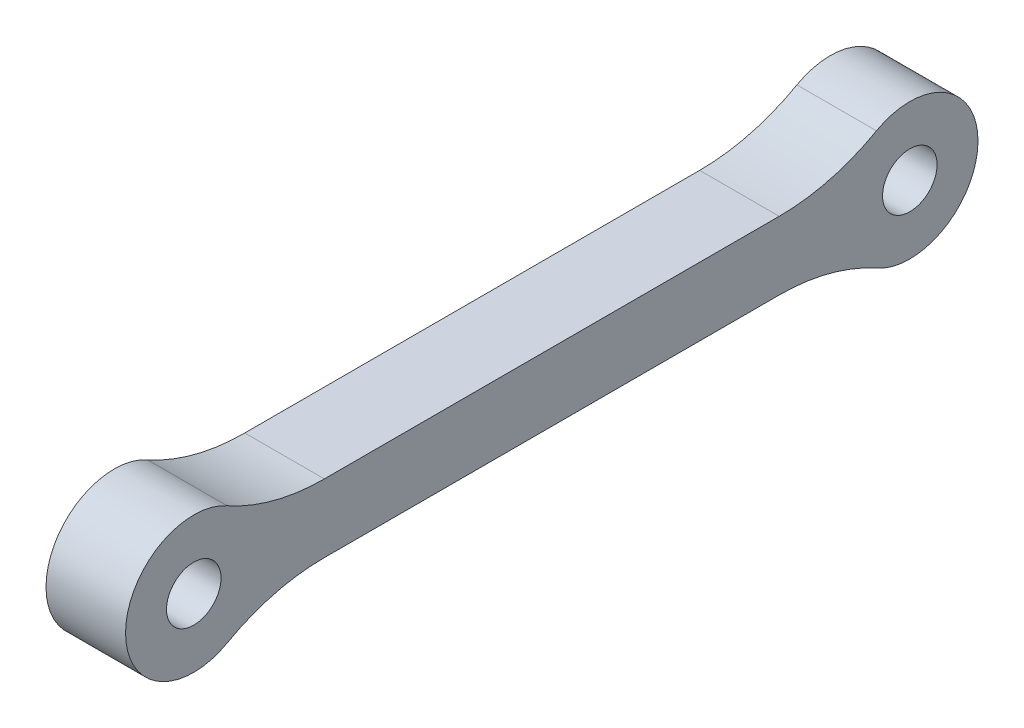
ISO-10303-21;
HEADER;
FILE_DESCRIPTION(('STEP AP214'),'2;1');
FILE_NAME('part.step','',(''),(''),'','','');
FILE_SCHEMA(('AUTOMOTIVE_DESIGN { 1 0 10303 214 1 1 1 1 }'));
ENDSEC;
DATA;
#1=APPLICATION_CONTEXT('core data for automotive mechanical design processes');
#2=APPLICATION_PROTOCOL_DEFINITION('international standard','automotive_design',2000,#1);
#3=PRODUCT_CONTEXT('',#1,'mechanical');
#4=PRODUCT('Part','Part','',(#3));
#5=PRODUCT_RELATED_PRODUCT_CATEGORY('part','',(#4));
#6=PRODUCT_DEFINITION_FORMATION('','',#4);
#7=PRODUCT_DEFINITION_CONTEXT('part definition',#1,'design');
#8=PRODUCT_DEFINITION('design','',#6,#7);
#9=PRODUCT_DEFINITION_SHAPE('','',#8);
#10=(LENGTH_UNIT() NAMED_UNIT(*) SI_UNIT(.MILLI.,.METRE.));
#11=(NAMED_UNIT(*) PLANE_ANGLE_UNIT() SI_UNIT($,.RADIAN.));
#12=(NAMED_UNIT(*) SI_UNIT($,.STERADIAN.) SOLID_ANGLE_UNIT());
#13=UNCERTAINTY_MEASURE_WITH_UNIT(LENGTH_MEASURE(1.E-05),#10,'distance_accuracy_value','');
#14=(GEOMETRIC_REPRESENTATION_CONTEXT(3) GLOBAL_UNCERTAINTY_ASSIGNED_CONTEXT((#13)) GLOBAL_UNIT_ASSIGNED_CONTEXT((#10,
#11,#12)) REPRESENTATION_CONTEXT('',''));
#15=CARTESIAN_POINT('',(0.,0.,0.));
#16=DIRECTION('',(0.,0.,1.));
#17=DIRECTION('',(1.,0.,0.));
#18=AXIS2_PLACEMENT_3D('',#15,#16,#17);
#19=CARTESIAN_POINT('',(4.,0.,0.));
#20=DIRECTION('',(1.,0.,0.));
#21=DIRECTION('',(0.,0.,-1.));
#22=AXIS2_PLACEMENT_3D('',#19,#20,#21);
#23=PLANE('',#22);
#24=CARTESIAN_POINT('',(4.,0.,0.));
#25=DIRECTION('',(1.,0.,0.));
#26=DIRECTION('',(0.,0.,-1.));
#27=AXIS2_PLACEMENT_3D('',#24,#25,#26);
#28=CIRCLE('',#27,1.37142857142857);
#29=CARTESIAN_POINT('',(4.,0.,-1.37142857142857));
#30=VERTEX_POINT('',#29);
#31=EDGE_CURVE('E142',#30,#30,#28,.T.);
#32=ORIENTED_EDGE('',*,*,#31,.F.);
#33=EDGE_LOOP('',(#32));
#34=FACE_BOUND('',#33,.T.);
#35=CARTESIAN_POINT('',(4.,0.,-36.));
#36=DIRECTION('',(1.,0.,0.));
#37=DIRECTION('',(0.,0.,-1.));
#38=AXIS2_PLACEMENT_3D('',#35,#36,#37);
#39=CIRCLE('',#38,3.42857142857143);
#40=CARTESIAN_POINT('',(4.,-2.99088145896657,-34.323775033229));
#41=VERTEX_POINT('',#40);
#42=CARTESIAN_POINT('',(4.,2.99088145896657,-34.323775033229));
#43=VERTEX_POINT('',#42);
#44=EDGE_CURVE('E153',#41,#43,#39,.T.);
#45=ORIENTED_EDGE('',*,*,#44,.T.);
#46=CARTESIAN_POINT('',(4.,11.7142857142857,-29.4347855468137));
#47=DIRECTION('',(1.,0.,0.));
#48=DIRECTION('',(0.,0.,-1.));
#49=AXIS2_PLACEMENT_3D('',#46,#47,#48);
#50=CIRCLE('',#49,10.);
#51=CARTESIAN_POINT('',(4.,1.71428571428571,-29.4347855468137));
#52=VERTEX_POINT('',#51);
#53=EDGE_CURVE('E11',#43,#52,#50,.F.);
#54=ORIENTED_EDGE('',*,*,#53,.T.);
#55=DIRECTION('',(0.,0.,1.));
#56=VECTOR('',#55,1.);
#57=CARTESIAN_POINT('',(4.,1.71428571428571,-18.));
#58=LINE('',#57,#56);
#59=CARTESIAN_POINT('',(4.,1.71428571428571,-6.56521445318632));
#60=VERTEX_POINT('',#59);
#61=EDGE_CURVE('E161',#52,#60,#58,.T.);
#62=ORIENTED_EDGE('',*,*,#61,.T.);
#63=CARTESIAN_POINT('',(4.,11.7142857142857,-6.56521445318632));
#64=DIRECTION('',(1.,0.,0.));
#65=DIRECTION('',(0.,0.,-1.));
#66=AXIS2_PLACEMENT_3D('',#63,#64,#65);
#67=CIRCLE('',#66,10.);
#68=CARTESIAN_POINT('',(4.,2.99088145896656,-1.67622496677098));
#69=VERTEX_POINT('',#68);
#70=EDGE_CURVE('E121',#60,#69,#67,.F.);
#71=ORIENTED_EDGE('',*,*,#70,.T.);
#72=CARTESIAN_POINT('',(4.,0.,0.));
#73=DIRECTION('',(1.,0.,0.));
#74=DIRECTION('',(0.,0.,-1.));
#75=AXIS2_PLACEMENT_3D('',#72,#73,#74);
#76=CIRCLE('',#75,3.42857142857143);
#77=CARTESIAN_POINT('',(4.,-2.99088145896656,-1.67622496677098));
#78=VERTEX_POINT('',#77);
#79=EDGE_CURVE('E131',#69,#78,#76,.T.);
#80=ORIENTED_EDGE('',*,*,#79,.T.);
#81=CARTESIAN_POINT('',(4.,-11.7142857142857,-6.56521445318632));
#82=DIRECTION('',(1.,0.,0.));
#83=DIRECTION('',(0.,0.,-1.));
#84=AXIS2_PLACEMENT_3D('',#81,#82,#83);
#85=CIRCLE('',#84,10.);
#86=CARTESIAN_POINT('',(4.,-1.71428571428571,-6.56521445318632));
#87=VERTEX_POINT('',#86);
#88=EDGE_CURVE('E185',#78,#87,#85,.F.);
#89=ORIENTED_EDGE('',*,*,#88,.T.);
#90=DIRECTION('',(0.,0.,-1.));
#91=VECTOR('',#90,1.);
#92=CARTESIAN_POINT('',(4.,-1.71428571428571,-18.));
#93=LINE('',#92,#91);
#94=CARTESIAN_POINT('',(4.,-1.71428571428571,-29.4347855468137));
#95=VERTEX_POINT('',#94);
#96=EDGE_CURVE('E207',#87,#95,#93,.T.);
#97=ORIENTED_EDGE('',*,*,#96,.T.);
#98=CARTESIAN_POINT('',(4.,-11.7142857142857,-29.4347855468137));
#99=DIRECTION('',(1.,0.,0.));
#100=DIRECTION('',(0.,0.,-1.));
#101=AXIS2_PLACEMENT_3D('',#98,#99,#100);
#102=CIRCLE('',#101,10.);
#103=EDGE_CURVE('E66',#95,#41,#102,.F.);
#104=ORIENTED_EDGE('',*,*,#103,.T.);
#105=EDGE_LOOP('',(#45,#54,#62,#71,#80,#89,#97,#104));
#106=FACE_BOUND('',#105,.T.);
#107=CARTESIAN_POINT('',(4.,0.,-36.));
#108=DIRECTION('',(1.,0.,0.));
#109=DIRECTION('',(0.,0.,-1.));
#110=AXIS2_PLACEMENT_3D('',#107,#108,#109);
#111=CIRCLE('',#110,1.37142857142857);
#112=CARTESIAN_POINT('',(4.,0.,-37.3714285714286));
#113=VERTEX_POINT('',#112);
#114=EDGE_CURVE('E355',#113,#113,#111,.T.);
#115=ORIENTED_EDGE('',*,*,#114,.F.);
#116=EDGE_LOOP('',(#115));
#117=FACE_BOUND('',#116,.T.);
#118=ADVANCED_FACE('F43',(#34,#106,#117),#23,.T.);
#119=CARTESIAN_POINT('',(0.,0.,0.));
#120=DIRECTION('',(1.,0.,0.));
#121=DIRECTION('',(0.,0.,-1.));
#122=AXIS2_PLACEMENT_3D('',#119,#120,#121);
#123=PLANE('',#122);
#124=CARTESIAN_POINT('',(0.,0.,0.));
#125=DIRECTION('',(1.,0.,0.));
#126=DIRECTION('',(0.,0.,-1.));
#127=AXIS2_PLACEMENT_3D('',#124,#125,#126);
#128=CIRCLE('',#127,3.42857142857143);
#129=CARTESIAN_POINT('',(0.,2.99088145896656,-1.67622496677098));
#130=VERTEX_POINT('',#129);
#131=CARTESIAN_POINT('',(0.,-2.99088145896656,-1.67622496677098));
#132=VERTEX_POINT('',#131);
#133=EDGE_CURVE('E128',#130,#132,#128,.T.);
#134=ORIENTED_EDGE('',*,*,#133,.F.);
#135=CARTESIAN_POINT('',(0.,11.7142857142857,-6.56521445318632));
#136=DIRECTION('',(1.,0.,0.));
#137=DIRECTION('',(0.,0.,-1.));
#138=AXIS2_PLACEMENT_3D('',#135,#136,#137);
#139=CIRCLE('',#138,10.);
#140=CARTESIAN_POINT('',(0.,1.71428571428571,-6.56521445318632));
#141=VERTEX_POINT('',#140);
#142=EDGE_CURVE('E110',#130,#141,#139,.T.);
#143=ORIENTED_EDGE('',*,*,#142,.T.);
#144=DIRECTION('',(0.,0.,1.));
#145=VECTOR('',#144,1.);
#146=CARTESIAN_POINT('',(0.,1.71428571428571,-18.));
#147=LINE('',#146,#145);
#148=CARTESIAN_POINT('',(0.,1.71428571428571,-29.4347855468137));
#149=VERTEX_POINT('',#148);
#150=EDGE_CURVE('E158',#149,#141,#147,.T.);
#151=ORIENTED_EDGE('',*,*,#150,.F.);
#152=CARTESIAN_POINT('',(0.,11.7142857142857,-29.4347855468137));
#153=DIRECTION('',(1.,0.,0.));
#154=DIRECTION('',(0.,0.,-1.));
#155=AXIS2_PLACEMENT_3D('',#152,#153,#154);
#156=CIRCLE('',#155,10.);
#157=CARTESIAN_POINT('',(0.,2.99088145896657,-34.323775033229));
#158=VERTEX_POINT('',#157);
#159=EDGE_CURVE('E52',#149,#158,#156,.T.);
#160=ORIENTED_EDGE('',*,*,#159,.T.);
#161=CARTESIAN_POINT('',(0.,0.,-36.));
#162=DIRECTION('',(1.,0.,0.));
#163=DIRECTION('',(0.,0.,-1.));
#164=AXIS2_PLACEMENT_3D('',#161,#162,#163);
#165=CIRCLE('',#164,3.42857142857143);
#166=CARTESIAN_POINT('',(0.,-2.99088145896657,-34.323775033229));
#167=VERTEX_POINT('',#166);
#168=EDGE_CURVE('E147',#167,#158,#165,.T.);
#169=ORIENTED_EDGE('',*,*,#168,.F.);
#170=CARTESIAN_POINT('',(0.,-11.7142857142857,-29.4347855468137));
#171=DIRECTION('',(1.,0.,0.));
#172=DIRECTION('',(0.,0.,-1.));
#173=AXIS2_PLACEMENT_3D('',#170,#171,#172);
#174=CIRCLE('',#173,10.);
#175=CARTESIAN_POINT('',(0.,-1.71428571428571,-29.4347855468137));
#176=VERTEX_POINT('',#175);
#177=EDGE_CURVE('E188',#167,#176,#174,.T.);
#178=ORIENTED_EDGE('',*,*,#177,.T.);
#179=DIRECTION('',(0.,0.,-1.));
#180=VECTOR('',#179,1.);
#181=CARTESIAN_POINT('',(0.,-1.71428571428571,-18.));
#182=LINE('',#181,#180);
#183=CARTESIAN_POINT('',(0.,-1.71428571428571,-6.56521445318632));
#184=VERTEX_POINT('',#183);
#185=EDGE_CURVE('E141',#184,#176,#182,.T.);
#186=ORIENTED_EDGE('',*,*,#185,.F.);
#187=CARTESIAN_POINT('',(0.,-11.7142857142857,-6.56521445318632));
#188=DIRECTION('',(1.,0.,0.));
#189=DIRECTION('',(0.,0.,-1.));
#190=AXIS2_PLACEMENT_3D('',#187,#188,#189);
#191=CIRCLE('',#190,10.);
#192=EDGE_CURVE('E139',#184,#132,#191,.T.);
#193=ORIENTED_EDGE('',*,*,#192,.T.);
#194=EDGE_LOOP('',(#134,#143,#151,#160,#169,#178,#186,#193));
#195=FACE_BOUND('',#194,.T.);
#196=CARTESIAN_POINT('',(0.,0.,0.));
#197=DIRECTION('',(1.,0.,0.));
#198=DIRECTION('',(0.,0.,-1.));
#199=AXIS2_PLACEMENT_3D('',#196,#197,#198);
#200=CIRCLE('',#199,1.37142857142857);
#201=CARTESIAN_POINT('',(0.,0.,-1.37142857142857));
#202=VERTEX_POINT('',#201);
#203=EDGE_CURVE('E150',#202,#202,#200,.T.);
#204=ORIENTED_EDGE('',*,*,#203,.T.);
#205=EDGE_LOOP('',(#204));
#206=FACE_BOUND('',#205,.T.);
#207=CARTESIAN_POINT('',(0.,0.,-36.));
#208=DIRECTION('',(1.,0.,0.));
#209=DIRECTION('',(0.,0.,-1.));
#210=AXIS2_PLACEMENT_3D('',#207,#208,#209);
#211=CIRCLE('',#210,1.37142857142857);
#212=CARTESIAN_POINT('',(0.,0.,-37.3714285714286));
#213=VERTEX_POINT('',#212);
#214=EDGE_CURVE('E358',#213,#213,#211,.T.);
#215=ORIENTED_EDGE('',*,*,#214,.T.);
#216=EDGE_LOOP('',(#215));
#217=FACE_BOUND('',#216,.T.);
#218=ADVANCED_FACE('F136',(#195,#206,#217),#123,.F.);
#219=CARTESIAN_POINT('',(4.,0.,0.));
#220=DIRECTION('',(-1.,0.,0.));
#221=DIRECTION('',(0.,0.,1.));
#222=AXIS2_PLACEMENT_3D('',#219,#220,#221);
#223=CYLINDRICAL_SURFACE('',#222,3.42857142857143);
#224=ORIENTED_EDGE('',*,*,#79,.F.);
#225=DIRECTION('',(-1.,0.,0.));
#226=VECTOR('',#225,1.);
#227=CARTESIAN_POINT('',(4.,2.99088145896656,-1.67622496677098));
#228=LINE('',#227,#226);
#229=EDGE_CURVE('E114',#69,#130,#228,.T.);
#230=ORIENTED_EDGE('',*,*,#229,.T.);
#231=ORIENTED_EDGE('',*,*,#133,.T.);
#232=DIRECTION('',(-1.,0.,0.));
#233=VECTOR('',#232,1.);
#234=CARTESIAN_POINT('',(4.,-2.99088145896656,-1.67622496677098));
#235=LINE('',#234,#233);
#236=EDGE_CURVE('E134',#132,#78,#235,.F.);
#237=ORIENTED_EDGE('',*,*,#236,.T.);
#238=EDGE_LOOP('',(#224,#230,#231,#237));
#239=FACE_BOUND('',#238,.T.);
#240=ADVANCED_FACE('F127',(#239),#223,.T.);
#241=CARTESIAN_POINT('',(4.,-1.71428571428571,-18.));
#242=DIRECTION('',(0.,1.,0.));
#243=DIRECTION('',(0.,0.,1.));
#244=AXIS2_PLACEMENT_3D('',#241,#242,#243);
#245=PLANE('',#244);
#246=ORIENTED_EDGE('',*,*,#96,.F.);
#247=DIRECTION('',(1.,0.,0.));
#248=VECTOR('',#247,1.);
#249=CARTESIAN_POINT('',(0.,-1.71428571428571,-6.56521445318632));
#250=LINE('',#249,#248);
#251=EDGE_CURVE('E172',#87,#184,#250,.F.);
#252=ORIENTED_EDGE('',*,*,#251,.T.);
#253=ORIENTED_EDGE('',*,*,#185,.T.);
#254=DIRECTION('',(1.,0.,0.));
#255=VECTOR('',#254,1.);
#256=CARTESIAN_POINT('',(4.,-1.71428571428571,-29.4347855468137));
#257=LINE('',#256,#255);
#258=EDGE_CURVE('E169',#176,#95,#257,.T.);
#259=ORIENTED_EDGE('',*,*,#258,.T.);
#260=EDGE_LOOP('',(#246,#252,#253,#259));
#261=FACE_BOUND('',#260,.T.);
#262=ADVANCED_FACE('F219',(#261),#245,.F.);
#263=CARTESIAN_POINT('',(4.,0.,-36.));
#264=DIRECTION('',(-1.,0.,0.));
#265=DIRECTION('',(0.,0.,1.));
#266=AXIS2_PLACEMENT_3D('',#263,#264,#265);
#267=CYLINDRICAL_SURFACE('',#266,3.42857142857143);
#268=ORIENTED_EDGE('',*,*,#44,.F.);
#269=DIRECTION('',(-1.,0.,0.));
#270=VECTOR('',#269,1.);
#271=CARTESIAN_POINT('',(4.,-2.99088145896657,-34.323775033229));
#272=LINE('',#271,#270);
#273=EDGE_CURVE('E122',#41,#167,#272,.T.);
#274=ORIENTED_EDGE('',*,*,#273,.T.);
#275=ORIENTED_EDGE('',*,*,#168,.T.);
#276=DIRECTION('',(-1.,0.,0.));
#277=VECTOR('',#276,1.);
#278=CARTESIAN_POINT('',(4.,2.99088145896657,-34.323775033229));
#279=LINE('',#278,#277);
#280=EDGE_CURVE('E59',#158,#43,#279,.F.);
#281=ORIENTED_EDGE('',*,*,#280,.T.);
#282=EDGE_LOOP('',(#268,#274,#275,#281));
#283=FACE_BOUND('',#282,.T.);
#284=ADVANCED_FACE('F196',(#283),#267,.T.);
#285=CARTESIAN_POINT('',(4.,1.71428571428571,-18.));
#286=DIRECTION('',(0.,-1.,0.));
#287=DIRECTION('',(0.,0.,-1.));
#288=AXIS2_PLACEMENT_3D('',#285,#286,#287);
#289=PLANE('',#288);
#290=ORIENTED_EDGE('',*,*,#150,.T.);
#291=DIRECTION('',(1.,0.,0.));
#292=VECTOR('',#291,1.);
#293=CARTESIAN_POINT('',(4.,1.71428571428571,-6.56521445318632));
#294=LINE('',#293,#292);
#295=EDGE_CURVE('E115',#141,#60,#294,.T.);
#296=ORIENTED_EDGE('',*,*,#295,.T.);
#297=ORIENTED_EDGE('',*,*,#61,.F.);
#298=DIRECTION('',(1.,0.,0.));
#299=VECTOR('',#298,1.);
#300=CARTESIAN_POINT('',(0.,1.71428571428571,-29.4347855468137));
#301=LINE('',#300,#299);
#302=EDGE_CURVE('E133',#52,#149,#301,.F.);
#303=ORIENTED_EDGE('',*,*,#302,.T.);
#304=EDGE_LOOP('',(#290,#296,#297,#303));
#305=FACE_BOUND('',#304,.T.);
#306=ADVANCED_FACE('F203',(#305),#289,.F.);
#307=CARTESIAN_POINT('',(4.,0.,0.));
#308=DIRECTION('',(-1.,0.,0.));
#309=DIRECTION('',(0.,0.,1.));
#310=AXIS2_PLACEMENT_3D('',#307,#308,#309);
#311=CYLINDRICAL_SURFACE('',#310,1.37142857142857);
#312=ORIENTED_EDGE('',*,*,#31,.T.);
#313=EDGE_LOOP('',(#312));
#314=FACE_BOUND('',#313,.T.);
#315=ORIENTED_EDGE('',*,*,#203,.F.);
#316=EDGE_LOOP('',(#315));
#317=FACE_BOUND('',#316,.T.);
#318=ADVANCED_FACE('F239',(#314,#317),#311,.F.);
#319=CARTESIAN_POINT('',(4.,0.,-36.));
#320=DIRECTION('',(-1.,0.,0.));
#321=DIRECTION('',(0.,0.,1.));
#322=AXIS2_PLACEMENT_3D('',#319,#320,#321);
#323=CYLINDRICAL_SURFACE('',#322,1.37142857142857);
#324=ORIENTED_EDGE('',*,*,#114,.T.);
#325=EDGE_LOOP('',(#324));
#326=FACE_BOUND('',#325,.T.);
#327=ORIENTED_EDGE('',*,*,#214,.F.);
#328=EDGE_LOOP('',(#327));
#329=FACE_BOUND('',#328,.T.);
#330=ADVANCED_FACE('F228',(#326,#329),#323,.F.);
#331=CARTESIAN_POINT('',(4.,11.7142857142857,-6.56521445318632));
#332=DIRECTION('',(-1.,0.,0.));
#333=DIRECTION('',(0.,0.,1.));
#334=AXIS2_PLACEMENT_3D('',#331,#332,#333);
#335=CYLINDRICAL_SURFACE('',#334,10.);
#336=ORIENTED_EDGE('',*,*,#70,.F.);
#337=ORIENTED_EDGE('',*,*,#295,.F.);
#338=ORIENTED_EDGE('',*,*,#142,.F.);
#339=ORIENTED_EDGE('',*,*,#229,.F.);
#340=EDGE_LOOP('',(#336,#337,#338,#339));
#341=FACE_BOUND('',#340,.T.);
#342=ADVANCED_FACE('F113',(#341),#335,.F.);
#343=CARTESIAN_POINT('',(4.,-11.7142857142857,-6.56521445318632));
#344=DIRECTION('',(-1.,0.,0.));
#345=DIRECTION('',(0.,0.,1.));
#346=AXIS2_PLACEMENT_3D('',#343,#344,#345);
#347=CYLINDRICAL_SURFACE('',#346,10.);
#348=ORIENTED_EDGE('',*,*,#88,.F.);
#349=ORIENTED_EDGE('',*,*,#236,.F.);
#350=ORIENTED_EDGE('',*,*,#192,.F.);
#351=ORIENTED_EDGE('',*,*,#251,.F.);
#352=EDGE_LOOP('',(#348,#349,#350,#351));
#353=FACE_BOUND('',#352,.T.);
#354=ADVANCED_FACE('F221',(#353),#347,.F.);
#355=CARTESIAN_POINT('',(4.,-11.7142857142857,-29.4347855468137));
#356=DIRECTION('',(-1.,0.,0.));
#357=DIRECTION('',(0.,0.,1.));
#358=AXIS2_PLACEMENT_3D('',#355,#356,#357);
#359=CYLINDRICAL_SURFACE('',#358,10.);
#360=ORIENTED_EDGE('',*,*,#103,.F.);
#361=ORIENTED_EDGE('',*,*,#258,.F.);
#362=ORIENTED_EDGE('',*,*,#177,.F.);
#363=ORIENTED_EDGE('',*,*,#273,.F.);
#364=EDGE_LOOP('',(#360,#361,#362,#363));
#365=FACE_BOUND('',#364,.T.);
#366=ADVANCED_FACE('F218',(#365),#359,.F.);
#367=CARTESIAN_POINT('',(4.,11.7142857142857,-29.4347855468137));
#368=DIRECTION('',(-1.,0.,0.));
#369=DIRECTION('',(0.,0.,1.));
#370=AXIS2_PLACEMENT_3D('',#367,#368,#369);
#371=CYLINDRICAL_SURFACE('',#370,10.);
#372=ORIENTED_EDGE('',*,*,#53,.F.);
#373=ORIENTED_EDGE('',*,*,#280,.F.);
#374=ORIENTED_EDGE('',*,*,#159,.F.);
#375=ORIENTED_EDGE('',*,*,#302,.F.);
#376=EDGE_LOOP('',(#372,#373,#374,#375));
#377=FACE_BOUND('',#376,.T.);
#378=ADVANCED_FACE('F45',(#377),#371,.F.);
#379=CLOSED_SHELL('',(#118,#218,#240,#262,#284,#306,#318,#330,#342,#354,#366,#378));
#380=MANIFOLD_SOLID_BREP('B2',#379);
#381=ADVANCED_BREP_SHAPE_REPRESENTATION('',(#18,#380),#14);
#382=SHAPE_DEFINITION_REPRESENTATION(#9,#381);
ENDSEC;
END-ISO-10303-21;
